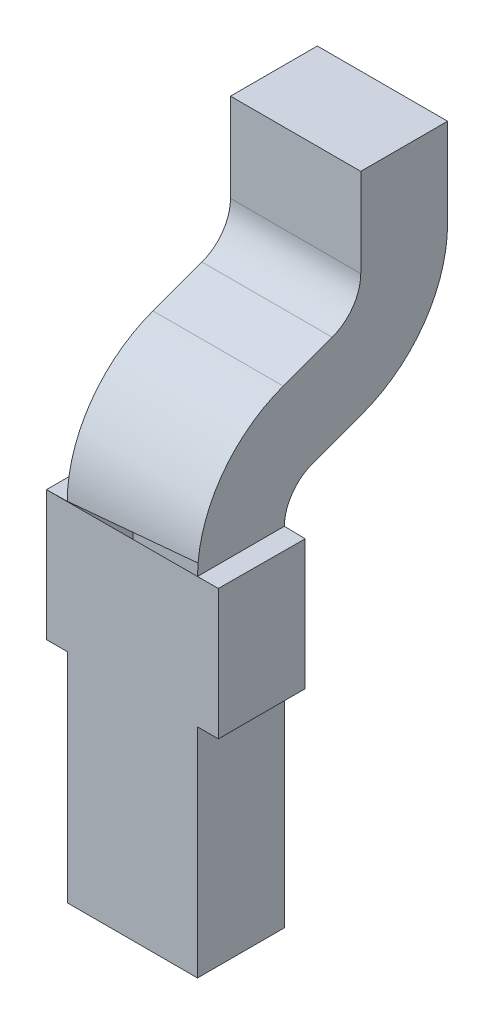
ISO-10303-21;
HEADER;
FILE_DESCRIPTION(('STEP AP214'),'2;1');
FILE_NAME('part.step','',(''),(''),'','','');
FILE_SCHEMA(('AUTOMOTIVE_DESIGN { 1 0 10303 214 1 1 1 1 }'));
ENDSEC;
DATA;
#1=APPLICATION_CONTEXT('core data for automotive mechanical design processes');
#2=APPLICATION_PROTOCOL_DEFINITION('international standard','automotive_design',2000,#1);
#3=PRODUCT_CONTEXT('',#1,'mechanical');
#4=PRODUCT('Part','Part','',(#3));
#5=PRODUCT_RELATED_PRODUCT_CATEGORY('part','',(#4));
#6=PRODUCT_DEFINITION_FORMATION('','',#4);
#7=PRODUCT_DEFINITION_CONTEXT('part definition',#1,'design');
#8=PRODUCT_DEFINITION('design','',#6,#7);
#9=PRODUCT_DEFINITION_SHAPE('','',#8);
#10=(LENGTH_UNIT() NAMED_UNIT(*) SI_UNIT(.MILLI.,.METRE.));
#11=(NAMED_UNIT(*) PLANE_ANGLE_UNIT() SI_UNIT($,.RADIAN.));
#12=(NAMED_UNIT(*) SI_UNIT($,.STERADIAN.) SOLID_ANGLE_UNIT());
#13=UNCERTAINTY_MEASURE_WITH_UNIT(LENGTH_MEASURE(1.E-05),#10,'distance_accuracy_value','');
#14=(GEOMETRIC_REPRESENTATION_CONTEXT(3) GLOBAL_UNCERTAINTY_ASSIGNED_CONTEXT((#13)) GLOBAL_UNIT_ASSIGNED_CONTEXT((#10,
#11,#12)) REPRESENTATION_CONTEXT('',''));
#15=CARTESIAN_POINT('',(0.,0.,0.));
#16=DIRECTION('',(0.,0.,1.));
#17=DIRECTION('',(1.,0.,0.));
#18=AXIS2_PLACEMENT_3D('',#15,#16,#17);
#19=CARTESIAN_POINT('',(131.189744279938,101.758469982888,143.086328634145));
#20=DIRECTION('',(1.,0.,0.));
#21=DIRECTION('',(0.,1.,0.));
#22=AXIS2_PLACEMENT_3D('',#19,#20,#21);
#23=PLANE('',#22);
#24=DIRECTION('',(0.,1.,0.));
#25=VECTOR('',#24,1.);
#26=CARTESIAN_POINT('',(131.189744279938,99.9047446285661,143.151470551509));
#27=LINE('',#26,#25);
#28=CARTESIAN_POINT('',(131.189744279938,99.9047446285661,143.151470551509));
#29=VERTEX_POINT('',#28);
#30=CARTESIAN_POINT('',(131.189744279938,101.15704329235,143.151470551509));
#31=VERTEX_POINT('',#30);
#32=EDGE_CURVE('E67',#29,#31,#27,.T.);
#33=ORIENTED_EDGE('',*,*,#32,.F.);
#34=DIRECTION('',(0.,0.,-1.));
#35=VECTOR('',#34,1.);
#36=CARTESIAN_POINT('',(131.189744279938,99.9047446285661,143.651470551509));
#37=LINE('',#36,#35);
#38=CARTESIAN_POINT('',(131.189744279938,99.9047446285661,143.651470551509));
#39=VERTEX_POINT('',#38);
#40=EDGE_CURVE('E293',#39,#29,#37,.T.);
#41=ORIENTED_EDGE('',*,*,#40,.F.);
#42=DIRECTION('',(0.,-1.,0.));
#43=VECTOR('',#42,1.);
#44=CARTESIAN_POINT('',(131.189744279938,101.904744628566,143.651470551509));
#45=LINE('',#44,#43);
#46=CARTESIAN_POINT('',(131.189744279938,101.15704329235,143.651470551509));
#47=VERTEX_POINT('',#46);
#48=EDGE_CURVE('E221',#47,#39,#45,.T.);
#49=ORIENTED_EDGE('',*,*,#48,.F.);
#50=DIRECTION('',(0.,0.,-1.));
#51=VECTOR('',#50,1.);
#52=CARTESIAN_POINT('',(131.189744279938,101.15704329235,142.648955771372));
#53=LINE('',#52,#51);
#54=EDGE_CURVE('E11',#47,#31,#53,.T.);
#55=ORIENTED_EDGE('',*,*,#54,.T.);
#56=EDGE_LOOP('',(#33,#41,#49,#55));
#57=FACE_BOUND('',#56,.T.);
#58=ADVANCED_FACE('F44',(#57),#23,.F.);
#59=CARTESIAN_POINT('',(137.094744279938,101.15704329235,142.211582908599));
#60=DIRECTION('',(0.,-1.,0.));
#61=DIRECTION('',(0.,0.,-1.));
#62=AXIS2_PLACEMENT_3D('',#59,#60,#61);
#63=PLANE('',#62);
#64=ORIENTED_EDGE('',*,*,#54,.F.);
#65=DIRECTION('',(1.,0.,0.));
#66=VECTOR('',#65,1.);
#67=CARTESIAN_POINT('',(134.577244279938,101.15704329235,143.651470551509));
#68=LINE('',#67,#66);
#69=CARTESIAN_POINT('',(131.069744279938,101.15704329235,143.651470551509));
#70=VERTEX_POINT('',#69);
#71=EDGE_CURVE('E322',#70,#47,#68,.T.);
#72=ORIENTED_EDGE('',*,*,#71,.F.);
#73=DIRECTION('',(0.,0.,-1.));
#74=VECTOR('',#73,1.);
#75=CARTESIAN_POINT('',(131.069744279938,101.15704329235,142.648955771372));
#76=LINE('',#75,#74);
#77=CARTESIAN_POINT('',(131.069744279938,101.15704329235,143.151470551509));
#78=VERTEX_POINT('',#77);
#79=EDGE_CURVE('E55',#70,#78,#76,.T.);
#80=ORIENTED_EDGE('',*,*,#79,.T.);
#81=DIRECTION('',(-1.,0.,0.));
#82=VECTOR('',#81,1.);
#83=CARTESIAN_POINT('',(134.577244279938,101.15704329235,143.151470551509));
#84=LINE('',#83,#82);
#85=EDGE_CURVE('E267',#31,#78,#84,.T.);
#86=ORIENTED_EDGE('',*,*,#85,.F.);
#87=EDGE_LOOP('',(#64,#72,#80,#86));
#88=FACE_BOUND('',#87,.T.);
#89=ADVANCED_FACE('F478',(#88),#63,.T.);
#90=CARTESIAN_POINT('',(131.069744279938,101.758469982888,143.086328634145));
#91=DIRECTION('',(1.,0.,0.));
#92=DIRECTION('',(0.,1.,0.));
#93=AXIS2_PLACEMENT_3D('',#90,#91,#92);
#94=PLANE('',#93);
#95=DIRECTION('',(0.,1.,0.));
#96=VECTOR('',#95,1.);
#97=CARTESIAN_POINT('',(131.069744279938,99.9047446285661,143.151470551509));
#98=LINE('',#97,#96);
#99=CARTESIAN_POINT('',(131.069744279938,101.904744628566,143.151470551509));
#100=VERTEX_POINT('',#99);
#101=EDGE_CURVE('E306',#78,#100,#98,.T.);
#102=ORIENTED_EDGE('',*,*,#101,.F.);
#103=ORIENTED_EDGE('',*,*,#79,.F.);
#104=DIRECTION('',(0.,-1.,0.));
#105=VECTOR('',#104,1.);
#106=CARTESIAN_POINT('',(131.069744279938,101.904744628566,143.651470551509));
#107=LINE('',#106,#105);
#108=CARTESIAN_POINT('',(131.069744279938,101.904744628566,143.651470551509));
#109=VERTEX_POINT('',#108);
#110=EDGE_CURVE('E326',#109,#70,#107,.T.);
#111=ORIENTED_EDGE('',*,*,#110,.F.);
#112=DIRECTION('',(0.,0.,1.));
#113=VECTOR('',#112,1.);
#114=CARTESIAN_POINT('',(131.069744279938,101.90704329235,142.648955771372));
#115=LINE('',#114,#113);
#116=EDGE_CURVE('E346',#100,#109,#115,.T.);
#117=ORIENTED_EDGE('',*,*,#116,.F.);
#118=EDGE_LOOP('',(#102,#103,#111,#117));
#119=FACE_BOUND('',#118,.T.);
#120=ADVANCED_FACE('F427',(#119),#94,.F.);
#121=CARTESIAN_POINT('',(130.594744279938,101.90704329235,142.211582908599));
#122=DIRECTION('',(0.,1.,0.));
#123=DIRECTION('',(1.,0.,0.));
#124=AXIS2_PLACEMENT_3D('',#121,#122,#123);
#125=PLANE('',#124);
#126=DIRECTION('',(1.,0.,0.));
#127=VECTOR('',#126,1.);
#128=CARTESIAN_POINT('',(132.059744279938,101.90704329235,143.151459983575));
#129=LINE('',#128,#127);
#130=CARTESIAN_POINT('',(131.189744279938,101.90704329235,143.151459983575));
#131=VERTEX_POINT('',#130);
#132=EDGE_CURVE('E232',#100,#131,#129,.T.);
#133=ORIENTED_EDGE('',*,*,#132,.F.);
#134=ORIENTED_EDGE('',*,*,#116,.T.);
#135=DIRECTION('',(1.,0.,0.));
#136=VECTOR('',#135,1.);
#137=CARTESIAN_POINT('',(132.059744279938,101.90704329235,143.651467028931));
#138=LINE('',#137,#136);
#139=CARTESIAN_POINT('',(131.189744279938,101.90704329235,143.651467028931));
#140=VERTEX_POINT('',#139);
#141=EDGE_CURVE('E270',#109,#140,#138,.T.);
#142=ORIENTED_EDGE('',*,*,#141,.T.);
#143=DIRECTION('',(0.,0.,1.));
#144=VECTOR('',#143,1.);
#145=CARTESIAN_POINT('',(131.189744279938,101.90704329235,142.648955771372));
#146=LINE('',#145,#144);
#147=EDGE_CURVE('E251',#131,#140,#146,.T.);
#148=ORIENTED_EDGE('',*,*,#147,.F.);
#149=EDGE_LOOP('',(#133,#134,#142,#148));
#150=FACE_BOUND('',#149,.T.);
#151=ADVANCED_FACE('F430',(#150),#125,.T.);
#152=CARTESIAN_POINT('',(131.189744279938,101.758469982888,143.086328634145));
#153=DIRECTION('',(1.,0.,0.));
#154=DIRECTION('',(0.,1.,0.));
#155=AXIS2_PLACEMENT_3D('',#152,#153,#154);
#156=PLANE('',#155);
#157=DIRECTION('',(0.,1.,0.));
#158=VECTOR('',#157,1.);
#159=CARTESIAN_POINT('',(131.189744279938,102.94704329235,142.211582908599));
#160=LINE('',#159,#158);
#161=CARTESIAN_POINT('',(131.189744279938,102.94704329235,142.211582908599));
#162=VERTEX_POINT('',#161);
#163=CARTESIAN_POINT('',(131.189744279938,103.45704329235,142.211582908599));
#164=VERTEX_POINT('',#163);
#165=EDGE_CURVE('E195',#162,#164,#160,.T.);
#166=ORIENTED_EDGE('',*,*,#165,.F.);
#167=CARTESIAN_POINT('',(131.189744279938,102.94704329235,142.961582908599));
#168=DIRECTION('',(1.,0.,0.));
#169=DIRECTION('',(0.,-0.939692620785816,-0.342020143325922));
#170=AXIS2_PLACEMENT_3D('',#167,#168,#169);
#171=CIRCLE('',#170,0.75);
#172=CARTESIAN_POINT('',(131.189744279938,102.242273826761,142.705067801105));
#173=VERTEX_POINT('',#172);
#174=EDGE_CURVE('E187',#173,#162,#171,.T.);
#175=ORIENTED_EDGE('',*,*,#174,.F.);
#176=DIRECTION('',(0.,0.342020143325932,-0.939692620785813));
#177=VECTOR('',#176,1.);
#178=CARTESIAN_POINT('',(131.189744279938,102.139667783763,142.986975587341));
#179=LINE('',#178,#177);
#180=CARTESIAN_POINT('',(131.189744279938,102.139667783763,142.986975587341));
#181=VERTEX_POINT('',#180);
#182=EDGE_CURVE('E191',#181,#173,#179,.T.);
#183=ORIENTED_EDGE('',*,*,#182,.F.);
#184=CARTESIAN_POINT('',(131.189744279938,101.904744628566,142.901470551509));
#185=DIRECTION('',(-1.,0.,0.));
#186=DIRECTION('',(0.,0.,1.));
#187=AXIS2_PLACEMENT_3D('',#184,#185,#186);
#188=CIRCLE('',#187,0.25);
#189=EDGE_CURVE('E229',#131,#181,#188,.T.);
#190=ORIENTED_EDGE('',*,*,#189,.F.);
#191=ORIENTED_EDGE('',*,*,#147,.T.);
#192=CARTESIAN_POINT('',(131.189744279938,101.904744628566,142.901470551509));
#193=DIRECTION('',(1.,0.,0.));
#194=DIRECTION('',(0.,0.939692620785816,0.342020143325922));
#195=AXIS2_PLACEMENT_3D('',#192,#193,#194);
#196=CIRCLE('',#195,0.75);
#197=CARTESIAN_POINT('',(131.189744279938,102.609514094156,143.157985659003));
#198=VERTEX_POINT('',#197);
#199=EDGE_CURVE('E299',#198,#140,#196,.T.);
#200=ORIENTED_EDGE('',*,*,#199,.F.);
#201=DIRECTION('',(0.,-0.342020143325932,0.939692620785813));
#202=VECTOR('',#201,1.);
#203=CARTESIAN_POINT('',(131.189744279938,102.712120137154,142.876077872768));
#204=LINE('',#203,#202);
#205=CARTESIAN_POINT('',(131.189744279938,102.712120137154,142.876077872768));
#206=VERTEX_POINT('',#205);
#207=EDGE_CURVE('E239',#206,#198,#204,.T.);
#208=ORIENTED_EDGE('',*,*,#207,.F.);
#209=CARTESIAN_POINT('',(131.189744279938,102.94704329235,142.961582908599));
#210=DIRECTION('',(-1.,0.,0.));
#211=DIRECTION('',(0.,0.,-1.));
#212=AXIS2_PLACEMENT_3D('',#209,#210,#211);
#213=CIRCLE('',#212,0.25);
#214=CARTESIAN_POINT('',(131.189744279938,102.94704329235,142.711582908599));
#215=VERTEX_POINT('',#214);
#216=EDGE_CURVE('E238',#215,#206,#213,.T.);
#217=ORIENTED_EDGE('',*,*,#216,.F.);
#218=DIRECTION('',(0.,-1.,0.));
#219=VECTOR('',#218,1.);
#220=CARTESIAN_POINT('',(131.189744279938,103.45704329235,142.711582908599));
#221=LINE('',#220,#219);
#222=CARTESIAN_POINT('',(131.189744279938,103.45704329235,142.711582908599));
#223=VERTEX_POINT('',#222);
#224=EDGE_CURVE('E223',#223,#215,#221,.T.);
#225=ORIENTED_EDGE('',*,*,#224,.F.);
#226=DIRECTION('',(0.,0.,1.));
#227=VECTOR('',#226,1.);
#228=CARTESIAN_POINT('',(131.189744279938,103.45704329235,142.211582908599));
#229=LINE('',#228,#227);
#230=EDGE_CURVE('E244',#164,#223,#229,.T.);
#231=ORIENTED_EDGE('',*,*,#230,.F.);
#232=EDGE_LOOP('',(#166,#175,#183,#190,#191,#200,#208,#217,#225,#231));
#233=FACE_BOUND('',#232,.T.);
#234=ADVANCED_FACE('F189',(#233),#156,.F.);
#235=CARTESIAN_POINT('',(131.939744279938,103.45704329235,142.711582908599));
#236=DIRECTION('',(0.,0.,1.));
#237=DIRECTION('',(1.,0.,0.));
#238=AXIS2_PLACEMENT_3D('',#235,#236,#237);
#239=PLANE('',#238);
#240=DIRECTION('',(-1.,0.,0.));
#241=VECTOR('',#240,1.);
#242=CARTESIAN_POINT('',(131.939744279938,103.45704329235,142.711582908599));
#243=LINE('',#242,#241);
#244=CARTESIAN_POINT('',(131.939744279938,103.45704329235,142.711582908599));
#245=VERTEX_POINT('',#244);
#246=EDGE_CURVE('E226',#245,#223,#243,.T.);
#247=ORIENTED_EDGE('',*,*,#246,.T.);
#248=ORIENTED_EDGE('',*,*,#224,.T.);
#249=DIRECTION('',(-1.,0.,0.));
#250=VECTOR('',#249,1.);
#251=CARTESIAN_POINT('',(131.939744279938,102.94704329235,142.711582908599));
#252=LINE('',#251,#250);
#253=CARTESIAN_POINT('',(131.939744279938,102.94704329235,142.711582908599));
#254=VERTEX_POINT('',#253);
#255=EDGE_CURVE('E227',#254,#215,#252,.T.);
#256=ORIENTED_EDGE('',*,*,#255,.F.);
#257=DIRECTION('',(0.,-1.,0.));
#258=VECTOR('',#257,1.);
#259=CARTESIAN_POINT('',(131.939744279938,103.45704329235,142.711582908599));
#260=LINE('',#259,#258);
#261=EDGE_CURVE('E271',#245,#254,#260,.T.);
#262=ORIENTED_EDGE('',*,*,#261,.F.);
#263=EDGE_LOOP('',(#247,#248,#256,#262));
#264=FACE_BOUND('',#263,.T.);
#265=ADVANCED_FACE('F513',(#264),#239,.T.);
#266=CARTESIAN_POINT('',(131.939744279938,102.94704329235,142.961582908599));
#267=DIRECTION('',(1.,0.,0.));
#268=DIRECTION('',(0.,0.,-1.));
#269=AXIS2_PLACEMENT_3D('',#266,#267,#268);
#270=CYLINDRICAL_SURFACE('',#269,0.25);
#271=ORIENTED_EDGE('',*,*,#255,.T.);
#272=ORIENTED_EDGE('',*,*,#216,.T.);
#273=DIRECTION('',(-1.,0.,0.));
#274=VECTOR('',#273,1.);
#275=CARTESIAN_POINT('',(131.939744279938,102.712120137154,142.876077872768));
#276=LINE('',#275,#274);
#277=CARTESIAN_POINT('',(131.939744279938,102.712120137154,142.876077872768));
#278=VERTEX_POINT('',#277);
#279=EDGE_CURVE('E234',#278,#206,#276,.T.);
#280=ORIENTED_EDGE('',*,*,#279,.F.);
#281=CARTESIAN_POINT('',(131.939744279938,102.94704329235,142.961582908599));
#282=DIRECTION('',(-1.,0.,0.));
#283=DIRECTION('',(0.,0.,-1.));
#284=AXIS2_PLACEMENT_3D('',#281,#282,#283);
#285=CIRCLE('',#284,0.25);
#286=EDGE_CURVE('E256',#254,#278,#285,.T.);
#287=ORIENTED_EDGE('',*,*,#286,.F.);
#288=EDGE_LOOP('',(#271,#272,#280,#287));
#289=FACE_BOUND('',#288,.T.);
#290=ADVANCED_FACE('F510',(#289),#270,.F.);
#291=CARTESIAN_POINT('',(131.939744279938,102.712120137154,142.876077872768));
#292=DIRECTION('',(0.,0.939692620785813,0.342020143325932));
#293=DIRECTION('',(1.,0.,0.));
#294=AXIS2_PLACEMENT_3D('',#291,#292,#293);
#295=PLANE('',#294);
#296=ORIENTED_EDGE('',*,*,#279,.T.);
#297=ORIENTED_EDGE('',*,*,#207,.T.);
#298=DIRECTION('',(-1.,0.,0.));
#299=VECTOR('',#298,1.);
#300=CARTESIAN_POINT('',(131.939744279938,102.609514094156,143.157985659003));
#301=LINE('',#300,#299);
#302=CARTESIAN_POINT('',(131.939744279938,102.609514094156,143.157985659003));
#303=VERTEX_POINT('',#302);
#304=EDGE_CURVE('E294',#303,#198,#301,.T.);
#305=ORIENTED_EDGE('',*,*,#304,.F.);
#306=DIRECTION('',(0.,-0.342020143325932,0.939692620785813));
#307=VECTOR('',#306,1.);
#308=CARTESIAN_POINT('',(131.939744279938,102.712120137154,142.876077872768));
#309=LINE('',#308,#307);
#310=EDGE_CURVE('E252',#278,#303,#309,.T.);
#311=ORIENTED_EDGE('',*,*,#310,.F.);
#312=EDGE_LOOP('',(#296,#297,#305,#311));
#313=FACE_BOUND('',#312,.T.);
#314=ADVANCED_FACE('F448',(#313),#295,.T.);
#315=CARTESIAN_POINT('',(131.939744279938,102.139667783763,142.986975587341));
#316=DIRECTION('',(0.,-0.939692620785813,-0.342020143325932));
#317=DIRECTION('',(0.,0.342020143325932,-0.939692620785813));
#318=AXIS2_PLACEMENT_3D('',#315,#316,#317);
#319=PLANE('',#318);
#320=DIRECTION('',(-1.,0.,0.));
#321=VECTOR('',#320,1.);
#322=CARTESIAN_POINT('',(131.939744279938,102.139667783763,142.986975587341));
#323=LINE('',#322,#321);
#324=CARTESIAN_POINT('',(131.939744279938,102.139667783763,142.986975587341));
#325=VERTEX_POINT('',#324);
#326=EDGE_CURVE('E209',#325,#181,#323,.T.);
#327=ORIENTED_EDGE('',*,*,#326,.T.);
#328=ORIENTED_EDGE('',*,*,#182,.T.);
#329=DIRECTION('',(-1.,0.,0.));
#330=VECTOR('',#329,1.);
#331=CARTESIAN_POINT('',(131.939744279938,102.242273826761,142.705067801105));
#332=LINE('',#331,#330);
#333=CARTESIAN_POINT('',(131.939744279938,102.242273826761,142.705067801105));
#334=VERTEX_POINT('',#333);
#335=EDGE_CURVE('E201',#334,#173,#332,.T.);
#336=ORIENTED_EDGE('',*,*,#335,.F.);
#337=DIRECTION('',(0.,0.342020143325932,-0.939692620785813));
#338=VECTOR('',#337,1.);
#339=CARTESIAN_POINT('',(131.939744279938,102.139667783763,142.986975587341));
#340=LINE('',#339,#338);
#341=EDGE_CURVE('E283',#325,#334,#340,.T.);
#342=ORIENTED_EDGE('',*,*,#341,.F.);
#343=EDGE_LOOP('',(#327,#328,#336,#342));
#344=FACE_BOUND('',#343,.T.);
#345=ADVANCED_FACE('F46',(#344),#319,.T.);
#346=CARTESIAN_POINT('',(131.939744279938,102.94704329235,142.961582908599));
#347=DIRECTION('',(1.,0.,0.));
#348=DIRECTION('',(0.,-0.939692620785816,-0.342020143325922));
#349=AXIS2_PLACEMENT_3D('',#346,#347,#348);
#350=CYLINDRICAL_SURFACE('',#349,0.75);
#351=ORIENTED_EDGE('',*,*,#335,.T.);
#352=ORIENTED_EDGE('',*,*,#174,.T.);
#353=DIRECTION('',(-1.,0.,0.));
#354=VECTOR('',#353,1.);
#355=CARTESIAN_POINT('',(131.939744279938,102.94704329235,142.211582908599));
#356=LINE('',#355,#354);
#357=CARTESIAN_POINT('',(131.939744279938,102.94704329235,142.211582908599));
#358=VERTEX_POINT('',#357);
#359=EDGE_CURVE('E202',#358,#162,#356,.T.);
#360=ORIENTED_EDGE('',*,*,#359,.F.);
#361=CARTESIAN_POINT('',(131.939744279938,102.94704329235,142.961582908599));
#362=DIRECTION('',(1.,0.,0.));
#363=DIRECTION('',(0.,-0.939692620785816,-0.342020143325922));
#364=AXIS2_PLACEMENT_3D('',#361,#362,#363);
#365=CIRCLE('',#364,0.75);
#366=EDGE_CURVE('E213',#334,#358,#365,.T.);
#367=ORIENTED_EDGE('',*,*,#366,.F.);
#368=EDGE_LOOP('',(#351,#352,#360,#367));
#369=FACE_BOUND('',#368,.T.);
#370=ADVANCED_FACE('F212',(#369),#350,.T.);
#371=CARTESIAN_POINT('',(131.939744279938,102.94704329235,142.211582908599));
#372=DIRECTION('',(0.,0.,-1.));
#373=DIRECTION('',(0.,-1.,0.));
#374=AXIS2_PLACEMENT_3D('',#371,#372,#373);
#375=PLANE('',#374);
#376=ORIENTED_EDGE('',*,*,#359,.T.);
#377=ORIENTED_EDGE('',*,*,#165,.T.);
#378=DIRECTION('',(-1.,0.,0.));
#379=VECTOR('',#378,1.);
#380=CARTESIAN_POINT('',(131.939744279938,103.45704329235,142.211582908599));
#381=LINE('',#380,#379);
#382=CARTESIAN_POINT('',(131.939744279938,103.45704329235,142.211582908599));
#383=VERTEX_POINT('',#382);
#384=EDGE_CURVE('E240',#383,#164,#381,.T.);
#385=ORIENTED_EDGE('',*,*,#384,.F.);
#386=DIRECTION('',(0.,1.,0.));
#387=VECTOR('',#386,1.);
#388=CARTESIAN_POINT('',(131.939744279938,102.94704329235,142.211582908599));
#389=LINE('',#388,#387);
#390=EDGE_CURVE('E280',#358,#383,#389,.T.);
#391=ORIENTED_EDGE('',*,*,#390,.F.);
#392=EDGE_LOOP('',(#376,#377,#385,#391));
#393=FACE_BOUND('',#392,.T.);
#394=ADVANCED_FACE('F498',(#393),#375,.T.);
#395=CARTESIAN_POINT('',(131.939744279938,103.45704329235,142.211582908599));
#396=DIRECTION('',(0.,1.,0.));
#397=DIRECTION('',(1.,0.,0.));
#398=AXIS2_PLACEMENT_3D('',#395,#396,#397);
#399=PLANE('',#398);
#400=ORIENTED_EDGE('',*,*,#384,.T.);
#401=ORIENTED_EDGE('',*,*,#230,.T.);
#402=ORIENTED_EDGE('',*,*,#246,.F.);
#403=DIRECTION('',(0.,0.,1.));
#404=VECTOR('',#403,1.);
#405=CARTESIAN_POINT('',(131.939744279938,103.45704329235,142.211582908599));
#406=LINE('',#405,#404);
#407=EDGE_CURVE('E275',#383,#245,#406,.T.);
#408=ORIENTED_EDGE('',*,*,#407,.F.);
#409=EDGE_LOOP('',(#400,#401,#402,#408));
#410=FACE_BOUND('',#409,.T.);
#411=ADVANCED_FACE('F495',(#410),#399,.T.);
#412=CARTESIAN_POINT('',(131.939744279938,99.9047446285661,143.651470551509));
#413=DIRECTION('',(0.,-1.,0.));
#414=DIRECTION('',(0.,0.,-1.));
#415=AXIS2_PLACEMENT_3D('',#412,#413,#414);
#416=PLANE('',#415);
#417=DIRECTION('',(-1.,0.,0.));
#418=VECTOR('',#417,1.);
#419=CARTESIAN_POINT('',(131.939744279938,99.9047446285661,143.651470551509));
#420=LINE('',#419,#418);
#421=CARTESIAN_POINT('',(131.939744279938,99.9047446285661,143.651470551509));
#422=VERTEX_POINT('',#421);
#423=EDGE_CURVE('E247',#422,#39,#420,.T.);
#424=ORIENTED_EDGE('',*,*,#423,.T.);
#425=ORIENTED_EDGE('',*,*,#40,.T.);
#426=DIRECTION('',(-1.,0.,0.));
#427=VECTOR('',#426,1.);
#428=CARTESIAN_POINT('',(131.939744279938,99.9047446285661,143.151470551509));
#429=LINE('',#428,#427);
#430=CARTESIAN_POINT('',(131.939744279938,99.9047446285661,143.151470551509));
#431=VERTEX_POINT('',#430);
#432=EDGE_CURVE('E266',#431,#29,#429,.T.);
#433=ORIENTED_EDGE('',*,*,#432,.F.);
#434=DIRECTION('',(0.,0.,-1.));
#435=VECTOR('',#434,1.);
#436=CARTESIAN_POINT('',(131.939744279938,99.9047446285661,143.651470551509));
#437=LINE('',#436,#435);
#438=EDGE_CURVE('E262',#422,#431,#437,.T.);
#439=ORIENTED_EDGE('',*,*,#438,.F.);
#440=EDGE_LOOP('',(#424,#425,#433,#439));
#441=FACE_BOUND('',#440,.T.);
#442=ADVANCED_FACE('F474',(#441),#416,.T.);
#443=CARTESIAN_POINT('',(131.939744279938,101.758469982888,143.086328634145));
#444=DIRECTION('',(1.,0.,0.));
#445=DIRECTION('',(0.,1.,0.));
#446=AXIS2_PLACEMENT_3D('',#443,#444,#445);
#447=PLANE('',#446);
#448=ORIENTED_EDGE('',*,*,#407,.T.);
#449=ORIENTED_EDGE('',*,*,#261,.T.);
#450=ORIENTED_EDGE('',*,*,#286,.T.);
#451=ORIENTED_EDGE('',*,*,#310,.T.);
#452=CARTESIAN_POINT('',(131.939744279938,101.904744628566,142.901470551509));
#453=DIRECTION('',(1.,0.,0.));
#454=DIRECTION('',(0.,0.939692620785816,0.342020143325922));
#455=AXIS2_PLACEMENT_3D('',#452,#453,#454);
#456=CIRCLE('',#455,0.75);
#457=CARTESIAN_POINT('',(131.939744279938,101.90704329235,143.651467028931));
#458=VERTEX_POINT('',#457);
#459=EDGE_CURVE('E257',#303,#458,#456,.T.);
#460=ORIENTED_EDGE('',*,*,#459,.T.);
#461=DIRECTION('',(0.,0.,1.));
#462=VECTOR('',#461,1.);
#463=CARTESIAN_POINT('',(131.939744279938,101.90704329235,142.648955771372));
#464=LINE('',#463,#462);
#465=CARTESIAN_POINT('',(131.939744279938,101.90704329235,143.151459983575));
#466=VERTEX_POINT('',#465);
#467=EDGE_CURVE('E263',#466,#458,#464,.T.);
#468=ORIENTED_EDGE('',*,*,#467,.F.);
#469=CARTESIAN_POINT('',(131.939744279938,101.904744628566,142.901470551509));
#470=DIRECTION('',(-1.,0.,0.));
#471=DIRECTION('',(0.,0.,1.));
#472=AXIS2_PLACEMENT_3D('',#469,#470,#471);
#473=CIRCLE('',#472,0.25);
#474=EDGE_CURVE('E313',#466,#325,#473,.T.);
#475=ORIENTED_EDGE('',*,*,#474,.T.);
#476=ORIENTED_EDGE('',*,*,#341,.T.);
#477=ORIENTED_EDGE('',*,*,#366,.T.);
#478=ORIENTED_EDGE('',*,*,#390,.T.);
#479=EDGE_LOOP('',(#448,#449,#450,#451,#460,#468,#475,#476,#477,#478));
#480=FACE_BOUND('',#479,.T.);
#481=ADVANCED_FACE('F444',(#480),#447,.T.);
#482=CARTESIAN_POINT('',(131.939744279938,101.758469982888,143.086328634145));
#483=DIRECTION('',(1.,0.,0.));
#484=DIRECTION('',(0.,1.,0.));
#485=AXIS2_PLACEMENT_3D('',#482,#483,#484);
#486=PLANE('',#485);
#487=DIRECTION('',(0.,0.,-1.));
#488=VECTOR('',#487,1.);
#489=CARTESIAN_POINT('',(131.939744279938,101.15704329235,142.648955771372));
#490=LINE('',#489,#488);
#491=CARTESIAN_POINT('',(131.939744279938,101.15704329235,143.651470551509));
#492=VERTEX_POINT('',#491);
#493=CARTESIAN_POINT('',(131.939744279938,101.15704329235,143.151470551509));
#494=VERTEX_POINT('',#493);
#495=EDGE_CURVE('E342',#492,#494,#490,.T.);
#496=ORIENTED_EDGE('',*,*,#495,.F.);
#497=DIRECTION('',(0.,-1.,0.));
#498=VECTOR('',#497,1.);
#499=CARTESIAN_POINT('',(131.939744279938,101.904744628566,143.651470551509));
#500=LINE('',#499,#498);
#501=EDGE_CURVE('E276',#492,#422,#500,.T.);
#502=ORIENTED_EDGE('',*,*,#501,.T.);
#503=ORIENTED_EDGE('',*,*,#438,.T.);
#504=DIRECTION('',(0.,1.,0.));
#505=VECTOR('',#504,1.);
#506=CARTESIAN_POINT('',(131.939744279938,99.9047446285661,143.151470551509));
#507=LINE('',#506,#505);
#508=EDGE_CURVE('E258',#431,#494,#507,.T.);
#509=ORIENTED_EDGE('',*,*,#508,.T.);
#510=EDGE_LOOP('',(#496,#502,#503,#509));
#511=FACE_BOUND('',#510,.T.);
#512=ADVANCED_FACE('F470',(#511),#486,.T.);
#513=CARTESIAN_POINT('',(130.594744279938,101.90704329235,142.211582908599));
#514=DIRECTION('',(0.,1.,0.));
#515=DIRECTION('',(1.,0.,0.));
#516=AXIS2_PLACEMENT_3D('',#513,#514,#515);
#517=PLANE('',#516);
#518=DIRECTION('',(1.,0.,0.));
#519=VECTOR('',#518,1.);
#520=CARTESIAN_POINT('',(132.059744279938,101.90704329235,143.151459983575));
#521=LINE('',#520,#519);
#522=CARTESIAN_POINT('',(132.059744279938,101.904744628566,143.151470551509));
#523=VERTEX_POINT('',#522);
#524=EDGE_CURVE('E233',#466,#523,#521,.T.);
#525=ORIENTED_EDGE('',*,*,#524,.F.);
#526=ORIENTED_EDGE('',*,*,#467,.T.);
#527=DIRECTION('',(1.,0.,0.));
#528=VECTOR('',#527,1.);
#529=CARTESIAN_POINT('',(132.059744279938,101.90704329235,143.651467028931));
#530=LINE('',#529,#528);
#531=CARTESIAN_POINT('',(132.059744279938,101.90704329235,143.651467028931));
#532=VERTEX_POINT('',#531);
#533=EDGE_CURVE('E298',#458,#532,#530,.T.);
#534=ORIENTED_EDGE('',*,*,#533,.T.);
#535=DIRECTION('',(0.,0.,1.));
#536=VECTOR('',#535,1.);
#537=CARTESIAN_POINT('',(132.059744279938,101.90704329235,142.648955771372));
#538=LINE('',#537,#536);
#539=EDGE_CURVE('E389',#523,#532,#538,.T.);
#540=ORIENTED_EDGE('',*,*,#539,.F.);
#541=EDGE_LOOP('',(#525,#526,#534,#540));
#542=FACE_BOUND('',#541,.T.);
#543=ADVANCED_FACE('F440',(#542),#517,.T.);
#544=CARTESIAN_POINT('',(132.059744279938,101.904744628566,142.901470551509));
#545=DIRECTION('',(1.,0.,0.));
#546=DIRECTION('',(0.,0.939692620785816,0.342020143325922));
#547=AXIS2_PLACEMENT_3D('',#544,#545,#546);
#548=CYLINDRICAL_SURFACE('',#547,0.75);
#549=DIRECTION('',(-1.,0.,0.));
#550=VECTOR('',#549,1.);
#551=CARTESIAN_POINT('',(132.059744279938,101.904744628566,143.651470551509));
#552=LINE('',#551,#550);
#553=EDGE_CURVE('E302',#532,#109,#552,.T.);
#554=ORIENTED_EDGE('',*,*,#553,.F.);
#555=ORIENTED_EDGE('',*,*,#533,.F.);
#556=ORIENTED_EDGE('',*,*,#459,.F.);
#557=ORIENTED_EDGE('',*,*,#304,.T.);
#558=ORIENTED_EDGE('',*,*,#199,.T.);
#559=ORIENTED_EDGE('',*,*,#141,.F.);
#560=EDGE_LOOP('',(#554,#555,#556,#557,#558,#559));
#561=FACE_BOUND('',#560,.T.);
#562=ADVANCED_FACE('F438',(#561),#548,.T.);
#563=CARTESIAN_POINT('',(132.059744279938,101.904744628566,143.651470551509));
#564=DIRECTION('',(0.,0.,1.));
#565=DIRECTION('',(1.,0.,0.));
#566=AXIS2_PLACEMENT_3D('',#563,#564,#565);
#567=PLANE('',#566);
#568=DIRECTION('',(0.,-1.,0.));
#569=VECTOR('',#568,1.);
#570=CARTESIAN_POINT('',(132.059744279938,101.904744628566,143.651470551509));
#571=LINE('',#570,#569);
#572=CARTESIAN_POINT('',(132.059744279938,101.15704329235,143.651470551509));
#573=VERTEX_POINT('',#572);
#574=EDGE_CURVE('E392',#532,#573,#571,.T.);
#575=ORIENTED_EDGE('',*,*,#574,.F.);
#576=ORIENTED_EDGE('',*,*,#553,.T.);
#577=ORIENTED_EDGE('',*,*,#110,.T.);
#578=ORIENTED_EDGE('',*,*,#71,.T.);
#579=ORIENTED_EDGE('',*,*,#48,.T.);
#580=ORIENTED_EDGE('',*,*,#423,.F.);
#581=ORIENTED_EDGE('',*,*,#501,.F.);
#582=DIRECTION('',(1.,0.,0.));
#583=VECTOR('',#582,1.);
#584=CARTESIAN_POINT('',(134.577244279938,101.15704329235,143.651470551509));
#585=LINE('',#584,#583);
#586=EDGE_CURVE('E349',#492,#573,#585,.T.);
#587=ORIENTED_EDGE('',*,*,#586,.T.);
#588=EDGE_LOOP('',(#575,#576,#577,#578,#579,#580,#581,#587));
#589=FACE_BOUND('',#588,.T.);
#590=ADVANCED_FACE('F435',(#589),#567,.T.);
#591=CARTESIAN_POINT('',(137.094744279938,101.15704329235,142.211582908599));
#592=DIRECTION('',(0.,-1.,0.));
#593=DIRECTION('',(0.,0.,-1.));
#594=AXIS2_PLACEMENT_3D('',#591,#592,#593);
#595=PLANE('',#594);
#596=DIRECTION('',(0.,0.,-1.));
#597=VECTOR('',#596,1.);
#598=CARTESIAN_POINT('',(132.059744279938,101.15704329235,142.648955771372));
#599=LINE('',#598,#597);
#600=CARTESIAN_POINT('',(132.059744279938,101.15704329235,143.151470551509));
#601=VERTEX_POINT('',#600);
#602=EDGE_CURVE('E402',#573,#601,#599,.T.);
#603=ORIENTED_EDGE('',*,*,#602,.F.);
#604=ORIENTED_EDGE('',*,*,#586,.F.);
#605=ORIENTED_EDGE('',*,*,#495,.T.);
#606=DIRECTION('',(-1.,0.,0.));
#607=VECTOR('',#606,1.);
#608=CARTESIAN_POINT('',(134.577244279938,101.15704329235,143.151470551509));
#609=LINE('',#608,#607);
#610=EDGE_CURVE('E332',#601,#494,#609,.T.);
#611=ORIENTED_EDGE('',*,*,#610,.F.);
#612=EDGE_LOOP('',(#603,#604,#605,#611));
#613=FACE_BOUND('',#612,.T.);
#614=ADVANCED_FACE('F466',(#613),#595,.T.);
#615=CARTESIAN_POINT('',(132.059744279938,99.9047446285661,143.151470551509));
#616=DIRECTION('',(0.,0.,-1.));
#617=DIRECTION('',(-1.,0.,0.));
#618=AXIS2_PLACEMENT_3D('',#615,#616,#617);
#619=PLANE('',#618);
#620=DIRECTION('',(0.,1.,0.));
#621=VECTOR('',#620,1.);
#622=CARTESIAN_POINT('',(132.059744279938,99.9047446285661,143.151470551509));
#623=LINE('',#622,#621);
#624=EDGE_CURVE('E405',#601,#523,#623,.T.);
#625=ORIENTED_EDGE('',*,*,#624,.F.);
#626=ORIENTED_EDGE('',*,*,#610,.T.);
#627=ORIENTED_EDGE('',*,*,#508,.F.);
#628=ORIENTED_EDGE('',*,*,#432,.T.);
#629=ORIENTED_EDGE('',*,*,#32,.T.);
#630=ORIENTED_EDGE('',*,*,#85,.T.);
#631=ORIENTED_EDGE('',*,*,#101,.T.);
#632=DIRECTION('',(-1.,0.,0.));
#633=VECTOR('',#632,1.);
#634=CARTESIAN_POINT('',(132.059744279938,101.904744628566,143.151470551509));
#635=LINE('',#634,#633);
#636=EDGE_CURVE('E376',#523,#100,#635,.T.);
#637=ORIENTED_EDGE('',*,*,#636,.F.);
#638=EDGE_LOOP('',(#625,#626,#627,#628,#629,#630,#631,#637));
#639=FACE_BOUND('',#638,.T.);
#640=ADVANCED_FACE('F421',(#639),#619,.T.);
#641=CARTESIAN_POINT('',(132.059744279938,101.904744628566,142.901470551509));
#642=DIRECTION('',(1.,0.,0.));
#643=DIRECTION('',(0.,0.,1.));
#644=AXIS2_PLACEMENT_3D('',#641,#642,#643);
#645=CYLINDRICAL_SURFACE('',#644,0.25);
#646=ORIENTED_EDGE('',*,*,#636,.T.);
#647=ORIENTED_EDGE('',*,*,#132,.T.);
#648=ORIENTED_EDGE('',*,*,#189,.T.);
#649=ORIENTED_EDGE('',*,*,#326,.F.);
#650=ORIENTED_EDGE('',*,*,#474,.F.);
#651=ORIENTED_EDGE('',*,*,#524,.T.);
#652=EDGE_LOOP('',(#646,#647,#648,#649,#650,#651));
#653=FACE_BOUND('',#652,.T.);
#654=ADVANCED_FACE('F416',(#653),#645,.F.);
#655=CARTESIAN_POINT('',(132.059744279938,101.758469982888,143.086328634145));
#656=DIRECTION('',(1.,0.,0.));
#657=DIRECTION('',(0.,1.,0.));
#658=AXIS2_PLACEMENT_3D('',#655,#656,#657);
#659=PLANE('',#658);
#660=ORIENTED_EDGE('',*,*,#539,.T.);
#661=ORIENTED_EDGE('',*,*,#574,.T.);
#662=ORIENTED_EDGE('',*,*,#602,.T.);
#663=ORIENTED_EDGE('',*,*,#624,.T.);
#664=EDGE_LOOP('',(#660,#661,#662,#663));
#665=FACE_BOUND('',#664,.T.);
#666=ADVANCED_FACE('F463',(#665),#659,.T.);
#667=CLOSED_SHELL('',(#58,#89,#120,#151,#234,#265,#290,#314,#345,#370,#394,#411,#442,#481,#512,
#543,#562,#590,#614,#640,#654,#666));
#668=MANIFOLD_SOLID_BREP('B2',#667);
#669=ADVANCED_BREP_SHAPE_REPRESENTATION('',(#18,#668),#14);
#670=SHAPE_DEFINITION_REPRESENTATION(#9,#669);
ENDSEC;
END-ISO-10303-21;
